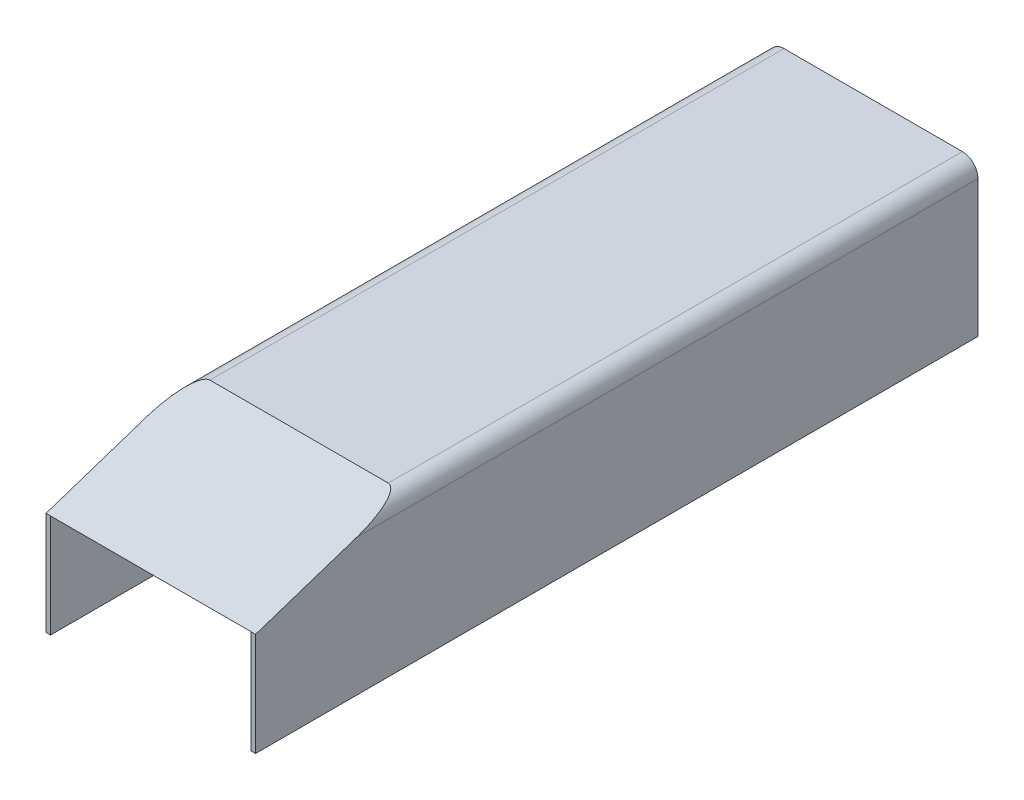
ISO-10303-21;
HEADER;
FILE_DESCRIPTION(('STEP AP214'),'2;1');
FILE_NAME('part.step','',(''),(''),'','','');
FILE_SCHEMA(('AUTOMOTIVE_DESIGN { 1 0 10303 214 1 1 1 1 }'));
ENDSEC;
DATA;
#1=APPLICATION_CONTEXT('core data for automotive mechanical design processes');
#2=APPLICATION_PROTOCOL_DEFINITION('international standard','automotive_design',2000,#1);
#3=PRODUCT_CONTEXT('',#1,'mechanical');
#4=PRODUCT('Part','Part','',(#3));
#5=PRODUCT_RELATED_PRODUCT_CATEGORY('part','',(#4));
#6=PRODUCT_DEFINITION_FORMATION('','',#4);
#7=PRODUCT_DEFINITION_CONTEXT('part definition',#1,'design');
#8=PRODUCT_DEFINITION('design','',#6,#7);
#9=PRODUCT_DEFINITION_SHAPE('','',#8);
#10=(LENGTH_UNIT() NAMED_UNIT(*) SI_UNIT(.MILLI.,.METRE.));
#11=(NAMED_UNIT(*) PLANE_ANGLE_UNIT() SI_UNIT($,.RADIAN.));
#12=(NAMED_UNIT(*) SI_UNIT($,.STERADIAN.) SOLID_ANGLE_UNIT());
#13=UNCERTAINTY_MEASURE_WITH_UNIT(LENGTH_MEASURE(1.E-05),#10,'distance_accuracy_value','');
#14=(GEOMETRIC_REPRESENTATION_CONTEXT(3) GLOBAL_UNCERTAINTY_ASSIGNED_CONTEXT((#13)) GLOBAL_UNIT_ASSIGNED_CONTEXT((#10,
#11,#12)) REPRESENTATION_CONTEXT('',''));
#15=CARTESIAN_POINT('',(0.,0.,0.));
#16=DIRECTION('',(0.,0.,1.));
#17=DIRECTION('',(1.,0.,0.));
#18=AXIS2_PLACEMENT_3D('',#15,#16,#17);
#19=CARTESIAN_POINT('',(0.,-77.851,0.));
#20=DIRECTION('',(0.,1.,0.));
#21=DIRECTION('',(0.,0.,1.));
#22=AXIS2_PLACEMENT_3D('',#19,#20,#21);
#23=PLANE('',#22);
#24=DIRECTION('',(0.,0.,-1.));
#25=VECTOR('',#24,1.);
#26=CARTESIAN_POINT('',(-119.38,-77.851,307.086));
#27=LINE('',#26,#25);
#28=CARTESIAN_POINT('',(-119.38,-77.851,666.242));
#29=VERTEX_POINT('',#28);
#30=CARTESIAN_POINT('',(-119.38,-77.851,-156.718));
#31=VERTEX_POINT('',#30);
#32=EDGE_CURVE('E196',#29,#31,#27,.T.);
#33=ORIENTED_EDGE('',*,*,#32,.T.);
#34=DIRECTION('',(-1.,0.,0.));
#35=VECTOR('',#34,1.);
#36=CARTESIAN_POINT('',(101.6,-77.851,-156.718));
#37=LINE('',#36,#35);
#38=CARTESIAN_POINT('',(-114.3,-77.851,-156.718));
#39=VERTEX_POINT('',#38);
#40=EDGE_CURVE('E172',#39,#31,#37,.T.);
#41=ORIENTED_EDGE('',*,*,#40,.F.);
#42=DIRECTION('',(0.,0.,-1.));
#43=VECTOR('',#42,1.);
#44=CARTESIAN_POINT('',(-114.3,-77.851,307.086));
#45=LINE('',#44,#43);
#46=CARTESIAN_POINT('',(-114.3,-77.851,666.242));
#47=VERTEX_POINT('',#46);
#48=EDGE_CURVE('E163',#47,#39,#45,.T.);
#49=ORIENTED_EDGE('',*,*,#48,.F.);
#50=DIRECTION('',(-1.,0.,0.));
#51=VECTOR('',#50,1.);
#52=CARTESIAN_POINT('',(-101.6,-77.851,666.242));
#53=LINE('',#52,#51);
#54=EDGE_CURVE('E246',#47,#29,#53,.T.);
#55=ORIENTED_EDGE('',*,*,#54,.T.);
#56=EDGE_LOOP('',(#33,#41,#49,#55));
#57=FACE_BOUND('',#56,.T.);
#58=ADVANCED_FACE('F36',(#57),#23,.F.);
#59=DIRECTION('',(0.,0.,-1.));
#60=VECTOR('',#59,1.);
#61=CARTESIAN_POINT('',(119.38,-77.851,307.086));
#62=LINE('',#61,#60);
#63=CARTESIAN_POINT('',(119.38,-77.851,666.242));
#64=VERTEX_POINT('',#63);
#65=CARTESIAN_POINT('',(119.38,-77.851,-156.718));
#66=VERTEX_POINT('',#65);
#67=EDGE_CURVE('E194',#64,#66,#62,.T.);
#68=ORIENTED_EDGE('',*,*,#67,.F.);
#69=CARTESIAN_POINT('',(114.3,-77.851,666.242));
#70=VERTEX_POINT('',#69);
#71=EDGE_CURVE('E157',#64,#70,#53,.T.);
#72=ORIENTED_EDGE('',*,*,#71,.T.);
#73=DIRECTION('',(0.,0.,-1.));
#74=VECTOR('',#73,1.);
#75=CARTESIAN_POINT('',(114.3,-77.851,307.086));
#76=LINE('',#75,#74);
#77=CARTESIAN_POINT('',(114.3,-77.851,-156.718));
#78=VERTEX_POINT('',#77);
#79=EDGE_CURVE('E151',#70,#78,#76,.T.);
#80=ORIENTED_EDGE('',*,*,#79,.T.);
#81=EDGE_CURVE('E154',#66,#78,#37,.T.);
#82=ORIENTED_EDGE('',*,*,#81,.F.);
#83=EDGE_LOOP('',(#68,#72,#80,#82));
#84=FACE_BOUND('',#83,.T.);
#85=ADVANCED_FACE('F153',(#84),#23,.F.);
#86=CARTESIAN_POINT('',(-297.293356721748,0.,497.332));
#87=DIRECTION('',(0.,0.,1.));
#88=DIRECTION('',(1.,0.,0.));
#89=AXIS2_PLACEMENT_3D('',#86,#87,#88);
#90=PLANE('',#89);
#91=CARTESIAN_POINT('',(101.6,77.851,497.332));
#92=DIRECTION('',(0.,0.,1.));
#93=DIRECTION('',(1.,0.,0.));
#94=AXIS2_PLACEMENT_3D('',#91,#92,#93);
#95=CIRCLE('',#94,12.7);
#96=CARTESIAN_POINT('',(101.6,90.551,497.332));
#97=VERTEX_POINT('',#96);
#98=CARTESIAN_POINT('',(104.208530557427,90.2802223542331,497.332));
#99=VERTEX_POINT('',#98);
#100=EDGE_CURVE('E162',#97,#99,#95,.F.);
#101=ORIENTED_EDGE('',*,*,#100,.T.);
#102=DIRECTION('',(1.,0.,0.));
#103=VECTOR('',#102,1.);
#104=CARTESIAN_POINT('',(-297.293356721748,90.2802223542331,497.332));
#105=LINE('',#104,#103);
#106=CARTESIAN_POINT('',(-104.208530557427,90.2802223542331,497.332));
#107=VERTEX_POINT('',#106);
#108=EDGE_CURVE('E229',#107,#99,#105,.T.);
#109=ORIENTED_EDGE('',*,*,#108,.F.);
#110=CARTESIAN_POINT('',(-101.6,77.851,497.332));
#111=DIRECTION('',(0.,0.,1.));
#112=DIRECTION('',(1.,0.,0.));
#113=AXIS2_PLACEMENT_3D('',#110,#111,#112);
#114=CIRCLE('',#113,12.7);
#115=CARTESIAN_POINT('',(-101.6,90.551,497.332));
#116=VERTEX_POINT('',#115);
#117=EDGE_CURVE('E204',#107,#116,#114,.F.);
#118=ORIENTED_EDGE('',*,*,#117,.T.);
#119=DIRECTION('',(1.,0.,0.));
#120=VECTOR('',#119,1.);
#121=CARTESIAN_POINT('',(0.,90.551,497.332));
#122=LINE('',#121,#120);
#123=EDGE_CURVE('E201',#116,#97,#122,.T.);
#124=ORIENTED_EDGE('',*,*,#123,.T.);
#125=EDGE_LOOP('',(#101,#109,#118,#124));
#126=FACE_BOUND('',#125,.T.);
#127=ADVANCED_FACE('F334',(#126),#90,.F.);
#128=CARTESIAN_POINT('',(-101.6,95.631,156.718));
#129=DIRECTION('',(0.,-1.,0.));
#130=DIRECTION('',(1.,0.,0.));
#131=AXIS2_PLACEMENT_3D('',#128,#129,#130);
#132=PLANE('',#131);
#133=DIRECTION('',(-1.,0.,0.));
#134=VECTOR('',#133,1.);
#135=CARTESIAN_POINT('',(-101.6,95.631,-156.718));
#136=LINE('',#135,#134);
#137=CARTESIAN_POINT('',(101.6,95.631,-156.718));
#138=VERTEX_POINT('',#137);
#139=CARTESIAN_POINT('',(-101.6,95.631,-156.718));
#140=VERTEX_POINT('',#139);
#141=EDGE_CURVE('E287',#138,#140,#136,.T.);
#142=ORIENTED_EDGE('',*,*,#141,.T.);
#143=DIRECTION('',(0.,0.,-1.));
#144=VECTOR('',#143,1.);
#145=CARTESIAN_POINT('',(-101.6,95.631,156.718));
#146=LINE('',#145,#144);
#147=CARTESIAN_POINT('',(-101.6,95.631,497.332));
#148=VERTEX_POINT('',#147);
#149=EDGE_CURVE('E281',#148,#140,#146,.T.);
#150=ORIENTED_EDGE('',*,*,#149,.F.);
#151=DIRECTION('',(-1.,0.,0.));
#152=VECTOR('',#151,1.);
#153=CARTESIAN_POINT('',(0.,95.631,497.332));
#154=LINE('',#153,#152);
#155=CARTESIAN_POINT('',(101.6,95.631,497.332));
#156=VERTEX_POINT('',#155);
#157=EDGE_CURVE('E207',#156,#148,#154,.T.);
#158=ORIENTED_EDGE('',*,*,#157,.F.);
#159=DIRECTION('',(0.,0.,-1.));
#160=VECTOR('',#159,1.);
#161=CARTESIAN_POINT('',(101.6,95.631,156.718));
#162=LINE('',#161,#160);
#163=EDGE_CURVE('E288',#156,#138,#162,.T.);
#164=ORIENTED_EDGE('',*,*,#163,.T.);
#165=EDGE_LOOP('',(#142,#150,#158,#164));
#166=FACE_BOUND('',#165,.T.);
#167=ADVANCED_FACE('F284',(#166),#132,.F.);
#168=CARTESIAN_POINT('',(-101.6,90.551,156.718));
#169=DIRECTION('',(0.,-1.,0.));
#170=DIRECTION('',(0.,0.,-1.));
#171=AXIS2_PLACEMENT_3D('',#168,#169,#170);
#172=PLANE('',#171);
#173=DIRECTION('',(-1.,0.,0.));
#174=VECTOR('',#173,1.);
#175=CARTESIAN_POINT('',(-101.6,90.551,-156.718));
#176=LINE('',#175,#174);
#177=CARTESIAN_POINT('',(101.6,90.551,-156.718));
#178=VERTEX_POINT('',#177);
#179=CARTESIAN_POINT('',(-101.6,90.551,-156.718));
#180=VERTEX_POINT('',#179);
#181=EDGE_CURVE('E189',#178,#180,#176,.T.);
#182=ORIENTED_EDGE('',*,*,#181,.F.);
#183=DIRECTION('',(0.,0.,-1.));
#184=VECTOR('',#183,1.);
#185=CARTESIAN_POINT('',(101.6,90.551,156.718));
#186=LINE('',#185,#184);
#187=EDGE_CURVE('E299',#97,#178,#186,.T.);
#188=ORIENTED_EDGE('',*,*,#187,.F.);
#189=ORIENTED_EDGE('',*,*,#123,.F.);
#190=DIRECTION('',(0.,0.,-1.));
#191=VECTOR('',#190,1.);
#192=CARTESIAN_POINT('',(-101.6,90.551,156.718));
#193=LINE('',#192,#191);
#194=EDGE_CURVE('E304',#116,#180,#193,.T.);
#195=ORIENTED_EDGE('',*,*,#194,.T.);
#196=EDGE_LOOP('',(#182,#188,#189,#195));
#197=FACE_BOUND('',#196,.T.);
#198=ADVANCED_FACE('F327',(#197),#172,.T.);
#199=CARTESIAN_POINT('',(101.6,77.851,156.718));
#200=DIRECTION('',(0.,0.,-1.));
#201=DIRECTION('',(-1.,0.,0.));
#202=AXIS2_PLACEMENT_3D('',#199,#200,#201);
#203=CYLINDRICAL_SURFACE('',#202,17.78);
#204=CARTESIAN_POINT('',(101.6,77.851,551.076090909091));
#205=DIRECTION('',(0.,-0.949394711630172,-0.31408546850923));
#206=DIRECTION('',(0.,0.31408546850923,-0.949394711630172));
#207=AXIS2_PLACEMENT_3D('',#204,#205,#206);
#208=ELLIPSE('',#207,56.6087953205562,17.78);
#209=CARTESIAN_POINT('',(119.38,77.8509999999996,551.076090909094));
#210=VERTEX_POINT('',#209);
#211=EDGE_CURVE('E300',#210,#156,#208,.F.);
#212=ORIENTED_EDGE('',*,*,#211,.F.);
#213=DIRECTION('',(0.,0.,-1.));
#214=VECTOR('',#213,1.);
#215=CARTESIAN_POINT('',(119.38,77.851,156.718));
#216=LINE('',#215,#214);
#217=CARTESIAN_POINT('',(119.38,77.851,-156.718));
#218=VERTEX_POINT('',#217);
#219=EDGE_CURVE('E60',#210,#218,#216,.T.);
#220=ORIENTED_EDGE('',*,*,#219,.T.);
#221=CARTESIAN_POINT('',(101.6,77.851,-156.718));
#222=DIRECTION('',(0.,0.,-1.));
#223=DIRECTION('',(-1.,0.,0.));
#224=AXIS2_PLACEMENT_3D('',#221,#222,#223);
#225=CIRCLE('',#224,17.78);
#226=EDGE_CURVE('E295',#218,#138,#225,.F.);
#227=ORIENTED_EDGE('',*,*,#226,.T.);
#228=ORIENTED_EDGE('',*,*,#163,.F.);
#229=EDGE_LOOP('',(#212,#220,#227,#228));
#230=FACE_BOUND('',#229,.T.);
#231=ADVANCED_FACE('F318',(#230),#203,.T.);
#232=CARTESIAN_POINT('',(101.6,77.851,156.718));
#233=DIRECTION('',(0.,0.,-1.));
#234=DIRECTION('',(-1.,0.,0.));
#235=AXIS2_PLACEMENT_3D('',#232,#233,#234);
#236=CYLINDRICAL_SURFACE('',#235,12.7);
#237=CARTESIAN_POINT('',(101.6,77.851,-156.718));
#238=DIRECTION('',(0.,0.,1.));
#239=DIRECTION('',(1.,0.,0.));
#240=AXIS2_PLACEMENT_3D('',#237,#238,#239);
#241=CIRCLE('',#240,12.7);
#242=CARTESIAN_POINT('',(114.3,77.851,-156.718));
#243=VERTEX_POINT('',#242);
#244=EDGE_CURVE('E192',#243,#178,#241,.T.);
#245=ORIENTED_EDGE('',*,*,#244,.F.);
#246=DIRECTION('',(0.,0.,-1.));
#247=VECTOR('',#246,1.);
#248=CARTESIAN_POINT('',(114.3,77.851,156.718));
#249=LINE('',#248,#247);
#250=CARTESIAN_POINT('',(114.3,77.851,534.902149388932));
#251=VERTEX_POINT('',#250);
#252=EDGE_CURVE('E177',#251,#243,#249,.T.);
#253=ORIENTED_EDGE('',*,*,#252,.F.);
#254=CARTESIAN_POINT('',(101.6,77.851,534.902149388932));
#255=DIRECTION('',(0.,-0.949394711630172,-0.31408546850923));
#256=DIRECTION('',(0.,0.31408546850923,-0.949394711630172));
#257=AXIS2_PLACEMENT_3D('',#254,#255,#256);
#258=ELLIPSE('',#257,40.4348538003972,12.7);
#259=EDGE_CURVE('E243',#251,#99,#258,.F.);
#260=ORIENTED_EDGE('',*,*,#259,.T.);
#261=ORIENTED_EDGE('',*,*,#100,.F.);
#262=ORIENTED_EDGE('',*,*,#187,.T.);
#263=EDGE_LOOP('',(#245,#253,#260,#261,#262));
#264=FACE_BOUND('',#263,.T.);
#265=ADVANCED_FACE('F331',(#264),#236,.F.);
#266=CARTESIAN_POINT('',(-297.293356721748,39.751,0.));
#267=DIRECTION('',(0.,1.,0.));
#268=DIRECTION('',(0.,0.,1.));
#269=AXIS2_PLACEMENT_3D('',#266,#267,#268);
#270=PLANE('',#269);
#271=DIRECTION('',(0.,0.,-1.));
#272=VECTOR('',#271,1.);
#273=CARTESIAN_POINT('',(-114.3,39.751,666.242));
#274=LINE('',#273,#272);
#275=CARTESIAN_POINT('',(-114.3,39.751,666.242));
#276=VERTEX_POINT('',#275);
#277=CARTESIAN_POINT('',(-114.3,39.751,650.068058479841));
#278=VERTEX_POINT('',#277);
#279=EDGE_CURVE('E210',#276,#278,#274,.T.);
#280=ORIENTED_EDGE('',*,*,#279,.T.);
#281=DIRECTION('',(1.,0.,0.));
#282=VECTOR('',#281,1.);
#283=CARTESIAN_POINT('',(-297.293356721748,39.751,650.068058479841));
#284=LINE('',#283,#282);
#285=CARTESIAN_POINT('',(114.3,39.751,650.068058479841));
#286=VERTEX_POINT('',#285);
#287=EDGE_CURVE('E225',#278,#286,#284,.T.);
#288=ORIENTED_EDGE('',*,*,#287,.T.);
#289=DIRECTION('',(0.,0.,-1.));
#290=VECTOR('',#289,1.);
#291=CARTESIAN_POINT('',(114.3,39.751,666.242));
#292=LINE('',#291,#290);
#293=CARTESIAN_POINT('',(114.3,39.751,666.242));
#294=VERTEX_POINT('',#293);
#295=EDGE_CURVE('E213',#294,#286,#292,.T.);
#296=ORIENTED_EDGE('',*,*,#295,.F.);
#297=DIRECTION('',(1.,0.,0.));
#298=VECTOR('',#297,1.);
#299=CARTESIAN_POINT('',(-297.293356721748,39.751,666.242));
#300=LINE('',#299,#298);
#301=EDGE_CURVE('E232',#276,#294,#300,.T.);
#302=ORIENTED_EDGE('',*,*,#301,.F.);
#303=EDGE_LOOP('',(#280,#288,#296,#302));
#304=FACE_BOUND('',#303,.T.);
#305=ADVANCED_FACE('F272',(#304),#270,.F.);
#306=CARTESIAN_POINT('',(-297.293356721748,229.674074763008,75.9824006734763));
#307=DIRECTION('',(0.,-0.949394711630172,-0.31408546850923));
#308=DIRECTION('',(0.,0.31408546850923,-0.949394711630172));
#309=AXIS2_PLACEMENT_3D('',#306,#307,#308);
#310=PLANE('',#309);
#311=ORIENTED_EDGE('',*,*,#259,.F.);
#312=DIRECTION('',(0.,0.31408546850923,-0.949394711630172));
#313=VECTOR('',#312,1.);
#314=CARTESIAN_POINT('',(114.3,34.9274784827531,664.64824852061));
#315=LINE('',#314,#313);
#316=EDGE_CURVE('E45',#286,#251,#315,.T.);
#317=ORIENTED_EDGE('',*,*,#316,.F.);
#318=ORIENTED_EDGE('',*,*,#287,.F.);
#319=DIRECTION('',(0.,-0.31408546850923,0.949394711630172));
#320=VECTOR('',#319,1.);
#321=CARTESIAN_POINT('',(-114.3,34.9274784827531,664.64824852061));
#322=LINE('',#321,#320);
#323=CARTESIAN_POINT('',(-114.3,77.851,534.902149388932));
#324=VERTEX_POINT('',#323);
#325=EDGE_CURVE('E241',#324,#278,#322,.T.);
#326=ORIENTED_EDGE('',*,*,#325,.F.);
#327=CARTESIAN_POINT('',(-101.6,77.851,534.902149388932));
#328=DIRECTION('',(0.,-0.949394711630172,-0.31408546850923));
#329=DIRECTION('',(0.,0.31408546850923,-0.949394711630172));
#330=AXIS2_PLACEMENT_3D('',#327,#328,#329);
#331=ELLIPSE('',#330,40.4348538003972,12.7);
#332=EDGE_CURVE('E237',#107,#324,#331,.F.);
#333=ORIENTED_EDGE('',*,*,#332,.F.);
#334=ORIENTED_EDGE('',*,*,#108,.T.);
#335=EDGE_LOOP('',(#311,#317,#318,#326,#333,#334));
#336=FACE_BOUND('',#335,.T.);
#337=ADVANCED_FACE('F312',(#336),#310,.T.);
#338=CARTESIAN_POINT('',(-101.6,77.851,156.718));
#339=DIRECTION('',(0.,0.,-1.));
#340=DIRECTION('',(-1.,0.,0.));
#341=AXIS2_PLACEMENT_3D('',#338,#339,#340);
#342=CYLINDRICAL_SURFACE('',#341,12.7);
#343=CARTESIAN_POINT('',(-101.6,77.851,-156.718));
#344=DIRECTION('',(0.,0.,1.));
#345=DIRECTION('',(1.,0.,0.));
#346=AXIS2_PLACEMENT_3D('',#343,#344,#345);
#347=CIRCLE('',#346,12.7);
#348=CARTESIAN_POINT('',(-114.3,77.851,-156.718));
#349=VERTEX_POINT('',#348);
#350=EDGE_CURVE('E181',#180,#349,#347,.T.);
#351=ORIENTED_EDGE('',*,*,#350,.F.);
#352=ORIENTED_EDGE('',*,*,#194,.F.);
#353=ORIENTED_EDGE('',*,*,#117,.F.);
#354=ORIENTED_EDGE('',*,*,#332,.T.);
#355=DIRECTION('',(0.,0.,-1.));
#356=VECTOR('',#355,1.);
#357=CARTESIAN_POINT('',(-114.3,77.851,156.718));
#358=LINE('',#357,#356);
#359=EDGE_CURVE('E183',#324,#349,#358,.T.);
#360=ORIENTED_EDGE('',*,*,#359,.T.);
#361=EDGE_LOOP('',(#351,#352,#353,#354,#360));
#362=FACE_BOUND('',#361,.T.);
#363=ADVANCED_FACE('F307',(#362),#342,.F.);
#364=CARTESIAN_POINT('',(101.6,-77.851,-156.718));
#365=DIRECTION('',(0.,0.,1.));
#366=DIRECTION('',(1.,0.,0.));
#367=AXIS2_PLACEMENT_3D('',#364,#365,#366);
#368=PLANE('',#367);
#369=DIRECTION('',(0.,1.,0.));
#370=VECTOR('',#369,1.);
#371=CARTESIAN_POINT('',(119.38,-77.851,-156.718));
#372=LINE('',#371,#370);
#373=EDGE_CURVE('E171',#66,#218,#372,.T.);
#374=ORIENTED_EDGE('',*,*,#373,.F.);
#375=ORIENTED_EDGE('',*,*,#81,.T.);
#376=DIRECTION('',(0.,1.,0.));
#377=VECTOR('',#376,1.);
#378=CARTESIAN_POINT('',(114.3,-77.851,-156.718));
#379=LINE('',#378,#377);
#380=EDGE_CURVE('E169',#78,#243,#379,.T.);
#381=ORIENTED_EDGE('',*,*,#380,.T.);
#382=ORIENTED_EDGE('',*,*,#244,.T.);
#383=ORIENTED_EDGE('',*,*,#181,.T.);
#384=ORIENTED_EDGE('',*,*,#350,.T.);
#385=DIRECTION('',(0.,-1.,0.));
#386=VECTOR('',#385,1.);
#387=CARTESIAN_POINT('',(-114.3,77.851,-156.718));
#388=LINE('',#387,#386);
#389=EDGE_CURVE('E178',#349,#39,#388,.T.);
#390=ORIENTED_EDGE('',*,*,#389,.T.);
#391=ORIENTED_EDGE('',*,*,#40,.T.);
#392=DIRECTION('',(0.,-1.,0.));
#393=VECTOR('',#392,1.);
#394=CARTESIAN_POINT('',(-119.38,77.851,-156.718));
#395=LINE('',#394,#393);
#396=CARTESIAN_POINT('',(-119.38,77.851,-156.718));
#397=VERTEX_POINT('',#396);
#398=EDGE_CURVE('E261',#397,#31,#395,.T.);
#399=ORIENTED_EDGE('',*,*,#398,.F.);
#400=CARTESIAN_POINT('',(-101.6,77.851,-156.718));
#401=DIRECTION('',(0.,0.,-1.));
#402=DIRECTION('',(-1.,0.,0.));
#403=AXIS2_PLACEMENT_3D('',#400,#401,#402);
#404=CIRCLE('',#403,17.78);
#405=EDGE_CURVE('E296',#140,#397,#404,.F.);
#406=ORIENTED_EDGE('',*,*,#405,.F.);
#407=ORIENTED_EDGE('',*,*,#141,.F.);
#408=ORIENTED_EDGE('',*,*,#226,.F.);
#409=EDGE_LOOP('',(#374,#375,#381,#382,#383,#384,#390,#391,#399,#406,#407,#408));
#410=FACE_BOUND('',#409,.T.);
#411=ADVANCED_FACE('F167',(#410),#368,.F.);
#412=CARTESIAN_POINT('',(-101.6,77.851,156.718));
#413=DIRECTION('',(0.,0.,-1.));
#414=DIRECTION('',(-1.,0.,0.));
#415=AXIS2_PLACEMENT_3D('',#412,#413,#414);
#416=CYLINDRICAL_SURFACE('',#415,17.78);
#417=ORIENTED_EDGE('',*,*,#405,.T.);
#418=DIRECTION('',(0.,0.,-1.));
#419=VECTOR('',#418,1.);
#420=CARTESIAN_POINT('',(-119.38,77.851,156.718));
#421=LINE('',#420,#419);
#422=CARTESIAN_POINT('',(-119.38,77.8509999999995,551.076090909094));
#423=VERTEX_POINT('',#422);
#424=EDGE_CURVE('E53',#423,#397,#421,.T.);
#425=ORIENTED_EDGE('',*,*,#424,.F.);
#426=CARTESIAN_POINT('',(-101.6,77.851,551.076090909091));
#427=DIRECTION('',(0.,-0.949394711630172,-0.31408546850923));
#428=DIRECTION('',(0.,0.31408546850923,-0.949394711630172));
#429=AXIS2_PLACEMENT_3D('',#426,#427,#428);
#430=ELLIPSE('',#429,56.6087953205562,17.78);
#431=EDGE_CURVE('E11',#148,#423,#430,.F.);
#432=ORIENTED_EDGE('',*,*,#431,.F.);
#433=ORIENTED_EDGE('',*,*,#149,.T.);
#434=EDGE_LOOP('',(#417,#425,#432,#433));
#435=FACE_BOUND('',#434,.T.);
#436=ADVANCED_FACE('F280',(#435),#416,.T.);
#437=CARTESIAN_POINT('',(114.3,-77.851,156.718));
#438=DIRECTION('',(-1.,0.,0.));
#439=DIRECTION('',(0.,-1.,0.));
#440=AXIS2_PLACEMENT_3D('',#437,#438,#439);
#441=PLANE('',#440);
#442=ORIENTED_EDGE('',*,*,#79,.F.);
#443=DIRECTION('',(0.,-1.,0.));
#444=VECTOR('',#443,1.);
#445=CARTESIAN_POINT('',(114.3,39.751,666.242));
#446=LINE('',#445,#444);
#447=EDGE_CURVE('E216',#294,#70,#446,.T.);
#448=ORIENTED_EDGE('',*,*,#447,.F.);
#449=ORIENTED_EDGE('',*,*,#295,.T.);
#450=ORIENTED_EDGE('',*,*,#316,.T.);
#451=ORIENTED_EDGE('',*,*,#252,.T.);
#452=ORIENTED_EDGE('',*,*,#380,.F.);
#453=EDGE_LOOP('',(#442,#448,#449,#450,#451,#452));
#454=FACE_BOUND('',#453,.T.);
#455=ADVANCED_FACE('F175',(#454),#441,.T.);
#456=CARTESIAN_POINT('',(-119.38,77.851,156.718));
#457=DIRECTION('',(1.,0.,0.));
#458=DIRECTION('',(0.,1.,0.));
#459=AXIS2_PLACEMENT_3D('',#456,#457,#458);
#460=PLANE('',#459);
#461=ORIENTED_EDGE('',*,*,#32,.F.);
#462=DIRECTION('',(0.,-1.,0.));
#463=VECTOR('',#462,1.);
#464=CARTESIAN_POINT('',(-119.38,39.751,666.242));
#465=LINE('',#464,#463);
#466=CARTESIAN_POINT('',(-119.38,39.751,666.242));
#467=VERTEX_POINT('',#466);
#468=EDGE_CURVE('E224',#467,#29,#465,.T.);
#469=ORIENTED_EDGE('',*,*,#468,.F.);
#470=DIRECTION('',(0.,-0.31408546850923,0.949394711630172));
#471=VECTOR('',#470,1.);
#472=CARTESIAN_POINT('',(-119.38,234.496999898089,77.5779548535031));
#473=LINE('',#472,#471);
#474=EDGE_CURVE('E234',#423,#467,#473,.T.);
#475=ORIENTED_EDGE('',*,*,#474,.F.);
#476=ORIENTED_EDGE('',*,*,#424,.T.);
#477=ORIENTED_EDGE('',*,*,#398,.T.);
#478=EDGE_LOOP('',(#461,#469,#475,#476,#477));
#479=FACE_BOUND('',#478,.T.);
#480=ADVANCED_FACE('F258',(#479),#460,.F.);
#481=CARTESIAN_POINT('',(-297.293356721748,234.496999898089,77.5779548535031));
#482=DIRECTION('',(0.,-0.949394711630172,-0.31408546850923));
#483=DIRECTION('',(0.,0.31408546850923,-0.949394711630172));
#484=AXIS2_PLACEMENT_3D('',#481,#482,#483);
#485=PLANE('',#484);
#486=ORIENTED_EDGE('',*,*,#157,.T.);
#487=ORIENTED_EDGE('',*,*,#431,.T.);
#488=ORIENTED_EDGE('',*,*,#474,.T.);
#489=DIRECTION('',(-1.,0.,0.));
#490=VECTOR('',#489,1.);
#491=CARTESIAN_POINT('',(-119.38,39.751,666.242));
#492=LINE('',#491,#490);
#493=EDGE_CURVE('E221',#276,#467,#492,.T.);
#494=ORIENTED_EDGE('',*,*,#493,.F.);
#495=ORIENTED_EDGE('',*,*,#301,.T.);
#496=DIRECTION('',(-1.,0.,0.));
#497=VECTOR('',#496,1.);
#498=CARTESIAN_POINT('',(114.3,39.751,666.242));
#499=LINE('',#498,#497);
#500=CARTESIAN_POINT('',(119.38,39.751,666.242));
#501=VERTEX_POINT('',#500);
#502=EDGE_CURVE('E217',#501,#294,#499,.T.);
#503=ORIENTED_EDGE('',*,*,#502,.F.);
#504=DIRECTION('',(0.,0.31408546850923,-0.949394711630172));
#505=VECTOR('',#504,1.);
#506=CARTESIAN_POINT('',(119.38,234.496999898089,77.5779548535031));
#507=LINE('',#506,#505);
#508=EDGE_CURVE('E228',#501,#210,#507,.T.);
#509=ORIENTED_EDGE('',*,*,#508,.T.);
#510=ORIENTED_EDGE('',*,*,#211,.T.);
#511=EDGE_LOOP('',(#486,#487,#488,#494,#495,#503,#509,#510));
#512=FACE_BOUND('',#511,.T.);
#513=ADVANCED_FACE('F276',(#512),#485,.F.);
#514=CARTESIAN_POINT('',(-114.3,77.851,156.718));
#515=DIRECTION('',(1.,0.,0.));
#516=DIRECTION('',(0.,0.,-1.));
#517=AXIS2_PLACEMENT_3D('',#514,#515,#516);
#518=PLANE('',#517);
#519=DIRECTION('',(0.,1.,0.));
#520=VECTOR('',#519,1.);
#521=CARTESIAN_POINT('',(-114.3,-125.349,666.242));
#522=LINE('',#521,#520);
#523=EDGE_CURVE('E40',#47,#276,#522,.T.);
#524=ORIENTED_EDGE('',*,*,#523,.F.);
#525=ORIENTED_EDGE('',*,*,#48,.T.);
#526=ORIENTED_EDGE('',*,*,#389,.F.);
#527=ORIENTED_EDGE('',*,*,#359,.F.);
#528=ORIENTED_EDGE('',*,*,#325,.T.);
#529=ORIENTED_EDGE('',*,*,#279,.F.);
#530=EDGE_LOOP('',(#524,#525,#526,#527,#528,#529));
#531=FACE_BOUND('',#530,.T.);
#532=ADVANCED_FACE('F267',(#531),#518,.T.);
#533=CARTESIAN_POINT('',(-101.6,-125.349,666.242));
#534=DIRECTION('',(0.,0.,1.));
#535=DIRECTION('',(1.,0.,0.));
#536=AXIS2_PLACEMENT_3D('',#533,#534,#535);
#537=PLANE('',#536);
#538=ORIENTED_EDGE('',*,*,#54,.F.);
#539=ORIENTED_EDGE('',*,*,#523,.T.);
#540=ORIENTED_EDGE('',*,*,#493,.T.);
#541=ORIENTED_EDGE('',*,*,#468,.T.);
#542=EDGE_LOOP('',(#538,#539,#540,#541));
#543=FACE_BOUND('',#542,.T.);
#544=ADVANCED_FACE('F38',(#543),#537,.T.);
#545=CARTESIAN_POINT('',(119.38,-77.851,156.718));
#546=DIRECTION('',(-1.,0.,0.));
#547=DIRECTION('',(0.,0.,1.));
#548=AXIS2_PLACEMENT_3D('',#545,#546,#547);
#549=PLANE('',#548);
#550=DIRECTION('',(0.,1.,0.));
#551=VECTOR('',#550,1.);
#552=CARTESIAN_POINT('',(119.38,-125.349,666.242));
#553=LINE('',#552,#551);
#554=EDGE_CURVE('E220',#64,#501,#553,.T.);
#555=ORIENTED_EDGE('',*,*,#554,.F.);
#556=ORIENTED_EDGE('',*,*,#67,.T.);
#557=ORIENTED_EDGE('',*,*,#373,.T.);
#558=ORIENTED_EDGE('',*,*,#219,.F.);
#559=ORIENTED_EDGE('',*,*,#508,.F.);
#560=EDGE_LOOP('',(#555,#556,#557,#558,#559));
#561=FACE_BOUND('',#560,.T.);
#562=ADVANCED_FACE('F316',(#561),#549,.F.);
#563=ORIENTED_EDGE('',*,*,#71,.F.);
#564=ORIENTED_EDGE('',*,*,#554,.T.);
#565=ORIENTED_EDGE('',*,*,#502,.T.);
#566=ORIENTED_EDGE('',*,*,#447,.T.);
#567=EDGE_LOOP('',(#563,#564,#565,#566));
#568=FACE_BOUND('',#567,.T.);
#569=ADVANCED_FACE('F314',(#568),#537,.T.);
#570=CLOSED_SHELL('',(#58,#85,#127,#167,#198,#231,#265,#305,#337,#363,#411,#436,#455,#480,#513,
#532,#544,#562,#569));
#571=MANIFOLD_SOLID_BREP('B2',#570);
#572=ADVANCED_BREP_SHAPE_REPRESENTATION('',(#18,#571),#14);
#573=SHAPE_DEFINITION_REPRESENTATION(#9,#572);
ENDSEC;
END-ISO-10303-21;
